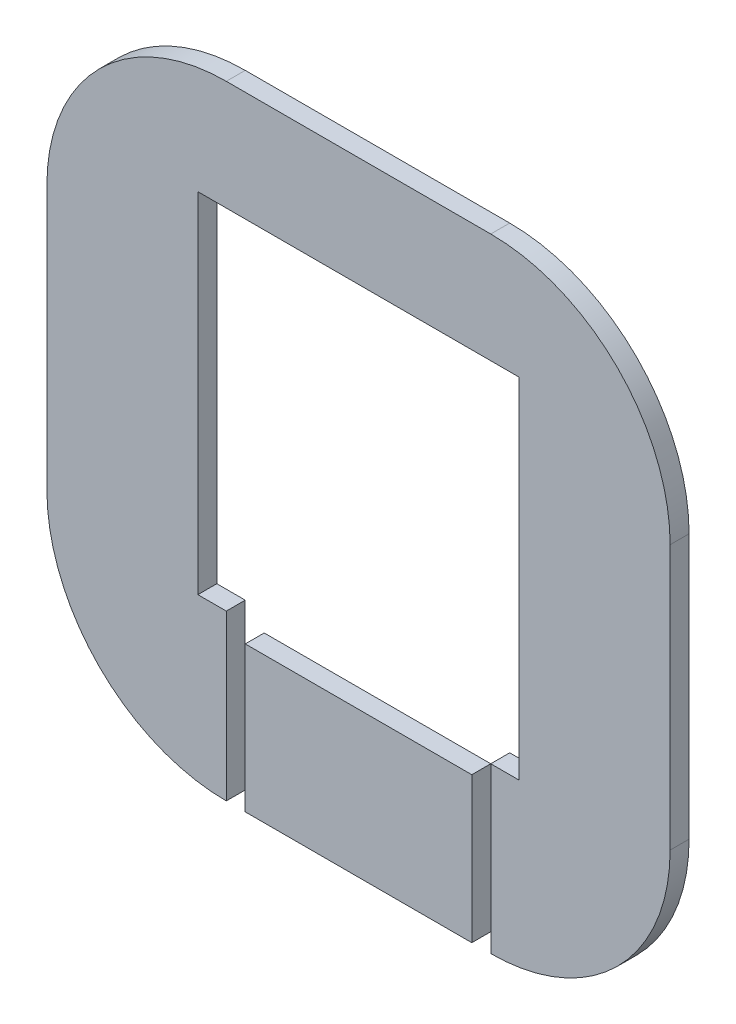
ISO-10303-21;
HEADER;
FILE_DESCRIPTION(('STEP AP214'),'2;1');
FILE_NAME('part.step','',(''),(''),'','','');
FILE_SCHEMA(('AUTOMOTIVE_DESIGN { 1 0 10303 214 1 1 1 1 }'));
ENDSEC;
DATA;
#1=APPLICATION_CONTEXT('core data for automotive mechanical design processes');
#2=APPLICATION_PROTOCOL_DEFINITION('international standard','automotive_design',2000,#1);
#3=PRODUCT_CONTEXT('',#1,'mechanical');
#4=PRODUCT('Part','Part','',(#3));
#5=PRODUCT_RELATED_PRODUCT_CATEGORY('part','',(#4));
#6=PRODUCT_DEFINITION_FORMATION('','',#4);
#7=PRODUCT_DEFINITION_CONTEXT('part definition',#1,'design');
#8=PRODUCT_DEFINITION('design','',#6,#7);
#9=PRODUCT_DEFINITION_SHAPE('','',#8);
#10=(LENGTH_UNIT() NAMED_UNIT(*) SI_UNIT(.MILLI.,.METRE.));
#11=(NAMED_UNIT(*) PLANE_ANGLE_UNIT() SI_UNIT($,.RADIAN.));
#12=(NAMED_UNIT(*) SI_UNIT($,.STERADIAN.) SOLID_ANGLE_UNIT());
#13=UNCERTAINTY_MEASURE_WITH_UNIT(LENGTH_MEASURE(1.E-05),#10,'distance_accuracy_value','');
#14=(GEOMETRIC_REPRESENTATION_CONTEXT(3) GLOBAL_UNCERTAINTY_ASSIGNED_CONTEXT((#13)) GLOBAL_UNIT_ASSIGNED_CONTEXT((#10,
#11,#12)) REPRESENTATION_CONTEXT('',''));
#15=CARTESIAN_POINT('',(0.,0.,0.));
#16=DIRECTION('',(0.,0.,1.));
#17=DIRECTION('',(1.,0.,0.));
#18=AXIS2_PLACEMENT_3D('',#15,#16,#17);
#19=CARTESIAN_POINT('',(30.,-51.5,4.3));
#20=DIRECTION('',(0.,0.,1.));
#21=DIRECTION('',(1.,0.,0.));
#22=AXIS2_PLACEMENT_3D('',#19,#20,#21);
#23=PLANE('',#22);
#24=DIRECTION('',(0.,1.,0.));
#25=VECTOR('',#24,1.);
#26=CARTESIAN_POINT('',(30.,0.,4.3));
#27=LINE('',#26,#25);
#28=CARTESIAN_POINT('',(30.,-92.2,4.3));
#29=VERTEX_POINT('',#28);
#30=CARTESIAN_POINT('',(30.,-54.89,4.3));
#31=VERTEX_POINT('',#30);
#32=EDGE_CURVE('E193',#29,#31,#27,.T.);
#33=ORIENTED_EDGE('',*,*,#32,.F.);
#34=CARTESIAN_POINT('',(30.,-51.5,4.3));
#35=DIRECTION('',(0.,0.,1.));
#36=DIRECTION('',(1.,0.,0.));
#37=AXIS2_PLACEMENT_3D('',#34,#35,#36);
#38=CIRCLE('',#37,40.7);
#39=CARTESIAN_POINT('',(70.7,-51.5,4.3));
#40=VERTEX_POINT('',#39);
#41=EDGE_CURVE('E260',#29,#40,#38,.T.);
#42=ORIENTED_EDGE('',*,*,#41,.T.);
#43=DIRECTION('',(0.,1.,0.));
#44=VECTOR('',#43,1.);
#45=CARTESIAN_POINT('',(70.7,8.50000000000001,4.3));
#46=LINE('',#45,#44);
#47=CARTESIAN_POINT('',(70.7,8.50000000000001,4.3));
#48=VERTEX_POINT('',#47);
#49=EDGE_CURVE('E258',#40,#48,#46,.T.);
#50=ORIENTED_EDGE('',*,*,#49,.T.);
#51=CARTESIAN_POINT('',(30.,8.50000000000001,4.3));
#52=DIRECTION('',(0.,0.,1.));
#53=DIRECTION('',(-1.,0.,0.));
#54=AXIS2_PLACEMENT_3D('',#51,#52,#53);
#55=CIRCLE('',#54,40.7);
#56=CARTESIAN_POINT('',(30.,49.2,4.3));
#57=VERTEX_POINT('',#56);
#58=EDGE_CURVE('E255',#48,#57,#55,.T.);
#59=ORIENTED_EDGE('',*,*,#58,.T.);
#60=DIRECTION('',(-1.,0.,0.));
#61=VECTOR('',#60,1.);
#62=CARTESIAN_POINT('',(-30.,49.2,4.3));
#63=LINE('',#62,#61);
#64=CARTESIAN_POINT('',(-30.,49.2,4.3));
#65=VERTEX_POINT('',#64);
#66=EDGE_CURVE('E252',#57,#65,#63,.T.);
#67=ORIENTED_EDGE('',*,*,#66,.T.);
#68=CARTESIAN_POINT('',(-30.,8.5,4.3));
#69=DIRECTION('',(0.,0.,1.));
#70=DIRECTION('',(-1.,0.,0.));
#71=AXIS2_PLACEMENT_3D('',#68,#69,#70);
#72=CIRCLE('',#71,40.7);
#73=CARTESIAN_POINT('',(-70.7,8.50000000000001,4.3));
#74=VERTEX_POINT('',#73);
#75=EDGE_CURVE('E249',#65,#74,#72,.T.);
#76=ORIENTED_EDGE('',*,*,#75,.T.);
#77=DIRECTION('',(0.,-1.,0.));
#78=VECTOR('',#77,1.);
#79=CARTESIAN_POINT('',(-70.7,8.50000000000001,4.3));
#80=LINE('',#79,#78);
#81=CARTESIAN_POINT('',(-70.7,-51.5,4.3));
#82=VERTEX_POINT('',#81);
#83=EDGE_CURVE('E246',#74,#82,#80,.T.);
#84=ORIENTED_EDGE('',*,*,#83,.T.);
#85=CARTESIAN_POINT('',(-30.,-51.5,4.3));
#86=DIRECTION('',(0.,0.,1.));
#87=DIRECTION('',(1.,0.,0.));
#88=AXIS2_PLACEMENT_3D('',#85,#86,#87);
#89=CIRCLE('',#88,40.7);
#90=CARTESIAN_POINT('',(-30.,-92.2,4.3));
#91=VERTEX_POINT('',#90);
#92=EDGE_CURVE('E203',#82,#91,#89,.T.);
#93=ORIENTED_EDGE('',*,*,#92,.T.);
#94=DIRECTION('',(0.,1.,0.));
#95=VECTOR('',#94,1.);
#96=CARTESIAN_POINT('',(-30.,0.,4.3));
#97=LINE('',#96,#95);
#98=CARTESIAN_POINT('',(-30.,-54.89,4.3));
#99=VERTEX_POINT('',#98);
#100=EDGE_CURVE('E199',#91,#99,#97,.T.);
#101=ORIENTED_EDGE('',*,*,#100,.T.);
#102=DIRECTION('',(1.,0.,0.));
#103=VECTOR('',#102,1.);
#104=CARTESIAN_POINT('',(0.,-54.89,4.3));
#105=LINE('',#104,#103);
#106=CARTESIAN_POINT('',(-36.45,-54.89,4.3));
#107=VERTEX_POINT('',#106);
#108=EDGE_CURVE('E159',#107,#99,#105,.T.);
#109=ORIENTED_EDGE('',*,*,#108,.F.);
#110=DIRECTION('',(0.,-1.,0.));
#111=VECTOR('',#110,1.);
#112=CARTESIAN_POINT('',(-36.45,0.,4.3));
#113=LINE('',#112,#111);
#114=CARTESIAN_POINT('',(-36.45,24.29,4.3));
#115=VERTEX_POINT('',#114);
#116=EDGE_CURVE('E155',#115,#107,#113,.T.);
#117=ORIENTED_EDGE('',*,*,#116,.F.);
#118=DIRECTION('',(1.,0.,0.));
#119=VECTOR('',#118,1.);
#120=CARTESIAN_POINT('',(0.,24.29,4.3));
#121=LINE('',#120,#119);
#122=CARTESIAN_POINT('',(36.45,24.29,4.3));
#123=VERTEX_POINT('',#122);
#124=EDGE_CURVE('E202',#115,#123,#121,.T.);
#125=ORIENTED_EDGE('',*,*,#124,.T.);
#126=DIRECTION('',(0.,-1.,0.));
#127=VECTOR('',#126,1.);
#128=CARTESIAN_POINT('',(36.45,0.,4.3));
#129=LINE('',#128,#127);
#130=CARTESIAN_POINT('',(36.45,-54.89,4.3));
#131=VERTEX_POINT('',#130);
#132=EDGE_CURVE('E207',#123,#131,#129,.T.);
#133=ORIENTED_EDGE('',*,*,#132,.T.);
#134=EDGE_CURVE('E194',#31,#131,#105,.T.);
#135=ORIENTED_EDGE('',*,*,#134,.F.);
#136=EDGE_LOOP('',(#33,#42,#50,#59,#67,#76,#84,#93,#101,#109,#117,#125,#133,#135));
#137=FACE_BOUND('',#136,.T.);
#138=ADVANCED_FACE('F92',(#137),#23,.T.);
#139=CARTESIAN_POINT('',(30.,-51.5,0.));
#140=DIRECTION('',(0.,0.,1.));
#141=DIRECTION('',(1.,0.,0.));
#142=AXIS2_PLACEMENT_3D('',#139,#140,#141);
#143=PLANE('',#142);
#144=CARTESIAN_POINT('',(30.,-51.5,0.));
#145=DIRECTION('',(0.,0.,1.));
#146=DIRECTION('',(1.,0.,0.));
#147=AXIS2_PLACEMENT_3D('',#144,#145,#146);
#148=CIRCLE('',#147,40.7);
#149=CARTESIAN_POINT('',(30.,-92.2,0.));
#150=VERTEX_POINT('',#149);
#151=CARTESIAN_POINT('',(70.7,-51.5,0.));
#152=VERTEX_POINT('',#151);
#153=EDGE_CURVE('E168',#150,#152,#148,.T.);
#154=ORIENTED_EDGE('',*,*,#153,.F.);
#155=DIRECTION('',(0.,1.,0.));
#156=VECTOR('',#155,1.);
#157=CARTESIAN_POINT('',(30.,0.,0.));
#158=LINE('',#157,#156);
#159=CARTESIAN_POINT('',(30.,-54.89,0.));
#160=VERTEX_POINT('',#159);
#161=EDGE_CURVE('E178',#150,#160,#158,.T.);
#162=ORIENTED_EDGE('',*,*,#161,.T.);
#163=DIRECTION('',(1.,0.,0.));
#164=VECTOR('',#163,1.);
#165=CARTESIAN_POINT('',(0.,-54.89,0.));
#166=LINE('',#165,#164);
#167=CARTESIAN_POINT('',(36.45,-54.89,0.));
#168=VERTEX_POINT('',#167);
#169=EDGE_CURVE('E170',#160,#168,#166,.T.);
#170=ORIENTED_EDGE('',*,*,#169,.T.);
#171=DIRECTION('',(0.,-1.,0.));
#172=VECTOR('',#171,1.);
#173=CARTESIAN_POINT('',(36.45,0.,0.));
#174=LINE('',#173,#172);
#175=CARTESIAN_POINT('',(36.45,24.29,0.));
#176=VERTEX_POINT('',#175);
#177=EDGE_CURVE('E95',#176,#168,#174,.T.);
#178=ORIENTED_EDGE('',*,*,#177,.F.);
#179=DIRECTION('',(1.,0.,0.));
#180=VECTOR('',#179,1.);
#181=CARTESIAN_POINT('',(0.,24.29,0.));
#182=LINE('',#181,#180);
#183=CARTESIAN_POINT('',(-36.45,24.29,0.));
#184=VERTEX_POINT('',#183);
#185=EDGE_CURVE('E175',#184,#176,#182,.T.);
#186=ORIENTED_EDGE('',*,*,#185,.F.);
#187=DIRECTION('',(0.,-1.,0.));
#188=VECTOR('',#187,1.);
#189=CARTESIAN_POINT('',(-36.45,0.,0.));
#190=LINE('',#189,#188);
#191=CARTESIAN_POINT('',(-36.45,-54.89,0.));
#192=VERTEX_POINT('',#191);
#193=EDGE_CURVE('E152',#184,#192,#190,.T.);
#194=ORIENTED_EDGE('',*,*,#193,.T.);
#195=CARTESIAN_POINT('',(-30.,-54.89,0.));
#196=VERTEX_POINT('',#195);
#197=EDGE_CURVE('E163',#192,#196,#166,.T.);
#198=ORIENTED_EDGE('',*,*,#197,.T.);
#199=DIRECTION('',(0.,1.,0.));
#200=VECTOR('',#199,1.);
#201=CARTESIAN_POINT('',(-30.,0.,0.));
#202=LINE('',#201,#200);
#203=CARTESIAN_POINT('',(-30.,-92.2,0.));
#204=VERTEX_POINT('',#203);
#205=EDGE_CURVE('E191',#204,#196,#202,.T.);
#206=ORIENTED_EDGE('',*,*,#205,.F.);
#207=CARTESIAN_POINT('',(-30.,-51.5,0.));
#208=DIRECTION('',(0.,0.,1.));
#209=DIRECTION('',(1.,0.,0.));
#210=AXIS2_PLACEMENT_3D('',#207,#208,#209);
#211=CIRCLE('',#210,40.7);
#212=CARTESIAN_POINT('',(-70.7,-51.5,0.));
#213=VERTEX_POINT('',#212);
#214=EDGE_CURVE('E218',#213,#204,#211,.T.);
#215=ORIENTED_EDGE('',*,*,#214,.F.);
#216=DIRECTION('',(0.,-1.,0.));
#217=VECTOR('',#216,1.);
#218=CARTESIAN_POINT('',(-70.7,8.50000000000001,0.));
#219=LINE('',#218,#217);
#220=CARTESIAN_POINT('',(-70.7,8.50000000000001,0.));
#221=VERTEX_POINT('',#220);
#222=EDGE_CURVE('E222',#221,#213,#219,.T.);
#223=ORIENTED_EDGE('',*,*,#222,.F.);
#224=CARTESIAN_POINT('',(-30.,8.5,0.));
#225=DIRECTION('',(0.,0.,1.));
#226=DIRECTION('',(-1.,0.,0.));
#227=AXIS2_PLACEMENT_3D('',#224,#225,#226);
#228=CIRCLE('',#227,40.7);
#229=CARTESIAN_POINT('',(-30.,49.2,0.));
#230=VERTEX_POINT('',#229);
#231=EDGE_CURVE('E226',#230,#221,#228,.T.);
#232=ORIENTED_EDGE('',*,*,#231,.F.);
#233=DIRECTION('',(-1.,0.,0.));
#234=VECTOR('',#233,1.);
#235=CARTESIAN_POINT('',(-30.,49.2,0.));
#236=LINE('',#235,#234);
#237=CARTESIAN_POINT('',(30.,49.2,0.));
#238=VERTEX_POINT('',#237);
#239=EDGE_CURVE('E230',#238,#230,#236,.T.);
#240=ORIENTED_EDGE('',*,*,#239,.F.);
#241=CARTESIAN_POINT('',(30.,8.50000000000001,0.));
#242=DIRECTION('',(0.,0.,1.));
#243=DIRECTION('',(-1.,0.,0.));
#244=AXIS2_PLACEMENT_3D('',#241,#242,#243);
#245=CIRCLE('',#244,40.7);
#246=CARTESIAN_POINT('',(70.7,8.50000000000001,0.));
#247=VERTEX_POINT('',#246);
#248=EDGE_CURVE('E234',#247,#238,#245,.T.);
#249=ORIENTED_EDGE('',*,*,#248,.F.);
#250=DIRECTION('',(0.,1.,0.));
#251=VECTOR('',#250,1.);
#252=CARTESIAN_POINT('',(70.7,8.50000000000001,0.));
#253=LINE('',#252,#251);
#254=EDGE_CURVE('E238',#152,#247,#253,.T.);
#255=ORIENTED_EDGE('',*,*,#254,.F.);
#256=EDGE_LOOP('',(#154,#162,#170,#178,#186,#194,#198,#206,#215,#223,#232,#240,#249,#255));
#257=FACE_BOUND('',#256,.T.);
#258=ADVANCED_FACE('F172',(#257),#143,.F.);
#259=CARTESIAN_POINT('',(30.,-51.5,4.3));
#260=DIRECTION('',(0.,0.,-1.));
#261=DIRECTION('',(-1.,0.,0.));
#262=AXIS2_PLACEMENT_3D('',#259,#260,#261);
#263=CYLINDRICAL_SURFACE('',#262,40.7);
#264=ORIENTED_EDGE('',*,*,#153,.T.);
#265=DIRECTION('',(0.,0.,-1.));
#266=VECTOR('',#265,1.);
#267=CARTESIAN_POINT('',(70.7,-51.5,4.3));
#268=LINE('',#267,#266);
#269=EDGE_CURVE('E237',#40,#152,#268,.T.);
#270=ORIENTED_EDGE('',*,*,#269,.F.);
#271=ORIENTED_EDGE('',*,*,#41,.F.);
#272=DIRECTION('',(0.,0.,-1.));
#273=VECTOR('',#272,1.);
#274=CARTESIAN_POINT('',(30.,-92.2,4.3));
#275=LINE('',#274,#273);
#276=EDGE_CURVE('E241',#29,#150,#275,.T.);
#277=ORIENTED_EDGE('',*,*,#276,.T.);
#278=EDGE_LOOP('',(#264,#270,#271,#277));
#279=FACE_BOUND('',#278,.T.);
#280=ADVANCED_FACE('F275',(#279),#263,.T.);
#281=CARTESIAN_POINT('',(70.7,8.50000000000001,4.3));
#282=DIRECTION('',(-1.,0.,0.));
#283=DIRECTION('',(0.,-1.,0.));
#284=AXIS2_PLACEMENT_3D('',#281,#282,#283);
#285=PLANE('',#284);
#286=ORIENTED_EDGE('',*,*,#254,.T.);
#287=DIRECTION('',(0.,0.,-1.));
#288=VECTOR('',#287,1.);
#289=CARTESIAN_POINT('',(70.7,8.50000000000001,4.3));
#290=LINE('',#289,#288);
#291=EDGE_CURVE('E233',#48,#247,#290,.T.);
#292=ORIENTED_EDGE('',*,*,#291,.F.);
#293=ORIENTED_EDGE('',*,*,#49,.F.);
#294=ORIENTED_EDGE('',*,*,#269,.T.);
#295=EDGE_LOOP('',(#286,#292,#293,#294));
#296=FACE_BOUND('',#295,.T.);
#297=ADVANCED_FACE('F280',(#296),#285,.F.);
#298=CARTESIAN_POINT('',(30.,8.50000000000001,4.3));
#299=DIRECTION('',(0.,0.,-1.));
#300=DIRECTION('',(-1.,0.,0.));
#301=AXIS2_PLACEMENT_3D('',#298,#299,#300);
#302=CYLINDRICAL_SURFACE('',#301,40.7);
#303=ORIENTED_EDGE('',*,*,#248,.T.);
#304=DIRECTION('',(0.,0.,-1.));
#305=VECTOR('',#304,1.);
#306=CARTESIAN_POINT('',(30.,49.2,4.3));
#307=LINE('',#306,#305);
#308=EDGE_CURVE('E229',#57,#238,#307,.T.);
#309=ORIENTED_EDGE('',*,*,#308,.F.);
#310=ORIENTED_EDGE('',*,*,#58,.F.);
#311=ORIENTED_EDGE('',*,*,#291,.T.);
#312=EDGE_LOOP('',(#303,#309,#310,#311));
#313=FACE_BOUND('',#312,.T.);
#314=ADVANCED_FACE('F290',(#313),#302,.T.);
#315=CARTESIAN_POINT('',(-30.,49.2,4.3));
#316=DIRECTION('',(0.,-1.,0.));
#317=DIRECTION('',(1.,0.,0.));
#318=AXIS2_PLACEMENT_3D('',#315,#316,#317);
#319=PLANE('',#318);
#320=ORIENTED_EDGE('',*,*,#239,.T.);
#321=DIRECTION('',(0.,0.,-1.));
#322=VECTOR('',#321,1.);
#323=CARTESIAN_POINT('',(-30.,49.2,4.3));
#324=LINE('',#323,#322);
#325=EDGE_CURVE('E225',#65,#230,#324,.T.);
#326=ORIENTED_EDGE('',*,*,#325,.F.);
#327=ORIENTED_EDGE('',*,*,#66,.F.);
#328=ORIENTED_EDGE('',*,*,#308,.T.);
#329=EDGE_LOOP('',(#320,#326,#327,#328));
#330=FACE_BOUND('',#329,.T.);
#331=ADVANCED_FACE('F371',(#330),#319,.F.);
#332=CARTESIAN_POINT('',(-30.,8.5,4.3));
#333=DIRECTION('',(0.,0.,-1.));
#334=DIRECTION('',(-1.,0.,0.));
#335=AXIS2_PLACEMENT_3D('',#332,#333,#334);
#336=CYLINDRICAL_SURFACE('',#335,40.7);
#337=ORIENTED_EDGE('',*,*,#231,.T.);
#338=DIRECTION('',(0.,0.,-1.));
#339=VECTOR('',#338,1.);
#340=CARTESIAN_POINT('',(-70.7,8.50000000000001,4.3));
#341=LINE('',#340,#339);
#342=EDGE_CURVE('E221',#74,#221,#341,.T.);
#343=ORIENTED_EDGE('',*,*,#342,.F.);
#344=ORIENTED_EDGE('',*,*,#75,.F.);
#345=ORIENTED_EDGE('',*,*,#325,.T.);
#346=EDGE_LOOP('',(#337,#343,#344,#345));
#347=FACE_BOUND('',#346,.T.);
#348=ADVANCED_FACE('F319',(#347),#336,.T.);
#349=CARTESIAN_POINT('',(-70.7,8.50000000000001,4.3));
#350=DIRECTION('',(1.,0.,0.));
#351=DIRECTION('',(0.,0.,-1.));
#352=AXIS2_PLACEMENT_3D('',#349,#350,#351);
#353=PLANE('',#352);
#354=ORIENTED_EDGE('',*,*,#222,.T.);
#355=DIRECTION('',(0.,0.,-1.));
#356=VECTOR('',#355,1.);
#357=CARTESIAN_POINT('',(-70.7,-51.5,4.3));
#358=LINE('',#357,#356);
#359=EDGE_CURVE('E216',#82,#213,#358,.T.);
#360=ORIENTED_EDGE('',*,*,#359,.F.);
#361=ORIENTED_EDGE('',*,*,#83,.F.);
#362=ORIENTED_EDGE('',*,*,#342,.T.);
#363=EDGE_LOOP('',(#354,#360,#361,#362));
#364=FACE_BOUND('',#363,.T.);
#365=ADVANCED_FACE('F324',(#364),#353,.F.);
#366=CARTESIAN_POINT('',(-30.,-51.5,4.3));
#367=DIRECTION('',(0.,0.,-1.));
#368=DIRECTION('',(-1.,0.,0.));
#369=AXIS2_PLACEMENT_3D('',#366,#367,#368);
#370=CYLINDRICAL_SURFACE('',#369,40.7);
#371=ORIENTED_EDGE('',*,*,#214,.T.);
#372=DIRECTION('',(0.,0.,-1.));
#373=VECTOR('',#372,1.);
#374=CARTESIAN_POINT('',(-30.,-92.2,4.3));
#375=LINE('',#374,#373);
#376=EDGE_CURVE('E198',#91,#204,#375,.T.);
#377=ORIENTED_EDGE('',*,*,#376,.F.);
#378=ORIENTED_EDGE('',*,*,#92,.F.);
#379=ORIENTED_EDGE('',*,*,#359,.T.);
#380=EDGE_LOOP('',(#371,#377,#378,#379));
#381=FACE_BOUND('',#380,.T.);
#382=ADVANCED_FACE('F329',(#381),#370,.T.);
#383=CARTESIAN_POINT('',(0.,-54.89,0.));
#384=DIRECTION('',(0.,-1.,0.));
#385=DIRECTION('',(0.,0.,-1.));
#386=AXIS2_PLACEMENT_3D('',#383,#384,#385);
#387=PLANE('',#386);
#388=ORIENTED_EDGE('',*,*,#134,.T.);
#389=DIRECTION('',(0.,0.,1.));
#390=VECTOR('',#389,1.);
#391=CARTESIAN_POINT('',(36.45,-54.89,0.));
#392=LINE('',#391,#390);
#393=EDGE_CURVE('E13',#168,#131,#392,.T.);
#394=ORIENTED_EDGE('',*,*,#393,.F.);
#395=ORIENTED_EDGE('',*,*,#169,.F.);
#396=DIRECTION('',(0.,0.,1.));
#397=VECTOR('',#396,1.);
#398=CARTESIAN_POINT('',(30.,-54.89,0.));
#399=LINE('',#398,#397);
#400=EDGE_CURVE('E192',#160,#31,#399,.T.);
#401=ORIENTED_EDGE('',*,*,#400,.T.);
#402=EDGE_LOOP('',(#388,#394,#395,#401));
#403=FACE_BOUND('',#402,.T.);
#404=ADVANCED_FACE('F338',(#403),#387,.F.);
#405=CARTESIAN_POINT('',(30.,0.,0.));
#406=DIRECTION('',(1.,0.,0.));
#407=DIRECTION('',(0.,0.,-1.));
#408=AXIS2_PLACEMENT_3D('',#405,#406,#407);
#409=PLANE('',#408);
#410=ORIENTED_EDGE('',*,*,#32,.T.);
#411=ORIENTED_EDGE('',*,*,#400,.F.);
#412=ORIENTED_EDGE('',*,*,#161,.F.);
#413=ORIENTED_EDGE('',*,*,#276,.F.);
#414=EDGE_LOOP('',(#410,#411,#412,#413));
#415=FACE_BOUND('',#414,.T.);
#416=ADVANCED_FACE('F302',(#415),#409,.F.);
#417=CARTESIAN_POINT('',(-30.,0.,0.));
#418=DIRECTION('',(1.,0.,0.));
#419=DIRECTION('',(0.,0.,-1.));
#420=AXIS2_PLACEMENT_3D('',#417,#418,#419);
#421=PLANE('',#420);
#422=ORIENTED_EDGE('',*,*,#100,.F.);
#423=ORIENTED_EDGE('',*,*,#376,.T.);
#424=ORIENTED_EDGE('',*,*,#205,.T.);
#425=DIRECTION('',(0.,0.,1.));
#426=VECTOR('',#425,1.);
#427=CARTESIAN_POINT('',(-30.,-54.89,0.));
#428=LINE('',#427,#426);
#429=EDGE_CURVE('E165',#196,#99,#428,.T.);
#430=ORIENTED_EDGE('',*,*,#429,.T.);
#431=EDGE_LOOP('',(#422,#423,#424,#430));
#432=FACE_BOUND('',#431,.T.);
#433=ADVANCED_FACE('F330',(#432),#421,.T.);
#434=ORIENTED_EDGE('',*,*,#108,.T.);
#435=ORIENTED_EDGE('',*,*,#429,.F.);
#436=ORIENTED_EDGE('',*,*,#197,.F.);
#437=DIRECTION('',(0.,0.,1.));
#438=VECTOR('',#437,1.);
#439=CARTESIAN_POINT('',(-36.45,-54.89,0.));
#440=LINE('',#439,#438);
#441=EDGE_CURVE('E148',#192,#107,#440,.T.);
#442=ORIENTED_EDGE('',*,*,#441,.T.);
#443=EDGE_LOOP('',(#434,#435,#436,#442));
#444=FACE_BOUND('',#443,.T.);
#445=ADVANCED_FACE('F164',(#444),#387,.F.);
#446=CARTESIAN_POINT('',(-36.45,0.,0.));
#447=DIRECTION('',(-1.,0.,0.));
#448=DIRECTION('',(0.,-1.,0.));
#449=AXIS2_PLACEMENT_3D('',#446,#447,#448);
#450=PLANE('',#449);
#451=ORIENTED_EDGE('',*,*,#116,.T.);
#452=ORIENTED_EDGE('',*,*,#441,.F.);
#453=ORIENTED_EDGE('',*,*,#193,.F.);
#454=DIRECTION('',(0.,0.,1.));
#455=VECTOR('',#454,1.);
#456=CARTESIAN_POINT('',(-36.45,24.29,0.));
#457=LINE('',#456,#455);
#458=EDGE_CURVE('E181',#184,#115,#457,.T.);
#459=ORIENTED_EDGE('',*,*,#458,.T.);
#460=EDGE_LOOP('',(#451,#452,#453,#459));
#461=FACE_BOUND('',#460,.T.);
#462=ADVANCED_FACE('F150',(#461),#450,.F.);
#463=CARTESIAN_POINT('',(0.,24.29,0.));
#464=DIRECTION('',(0.,-1.,0.));
#465=DIRECTION('',(0.,0.,-1.));
#466=AXIS2_PLACEMENT_3D('',#463,#464,#465);
#467=PLANE('',#466);
#468=ORIENTED_EDGE('',*,*,#124,.F.);
#469=ORIENTED_EDGE('',*,*,#458,.F.);
#470=ORIENTED_EDGE('',*,*,#185,.T.);
#471=DIRECTION('',(0.,0.,1.));
#472=VECTOR('',#471,1.);
#473=CARTESIAN_POINT('',(36.45,24.29,0.));
#474=LINE('',#473,#472);
#475=EDGE_CURVE('E180',#176,#123,#474,.T.);
#476=ORIENTED_EDGE('',*,*,#475,.T.);
#477=EDGE_LOOP('',(#468,#469,#470,#476));
#478=FACE_BOUND('',#477,.T.);
#479=ADVANCED_FACE('F358',(#478),#467,.T.);
#480=CARTESIAN_POINT('',(36.45,0.,0.));
#481=DIRECTION('',(-1.,0.,0.));
#482=DIRECTION('',(0.,-1.,0.));
#483=AXIS2_PLACEMENT_3D('',#480,#481,#482);
#484=PLANE('',#483);
#485=ORIENTED_EDGE('',*,*,#132,.F.);
#486=ORIENTED_EDGE('',*,*,#475,.F.);
#487=ORIENTED_EDGE('',*,*,#177,.T.);
#488=ORIENTED_EDGE('',*,*,#393,.T.);
#489=EDGE_LOOP('',(#485,#486,#487,#488));
#490=FACE_BOUND('',#489,.T.);
#491=ADVANCED_FACE('F356',(#490),#484,.T.);
#492=CLOSED_SHELL('',(#138,#258,#280,#297,#314,#331,#348,#365,#382,#404,#416,#433,#445,#462,
#479,#491));
#493=MANIFOLD_SOLID_BREP('B2',#492);
#494=CARTESIAN_POINT('',(30.,-51.5,0.));
#495=DIRECTION('',(0.,0.,1.));
#496=DIRECTION('',(1.,0.,0.));
#497=AXIS2_PLACEMENT_3D('',#494,#495,#496);
#498=PLANE('',#497);
#499=DIRECTION('',(1.,0.,0.));
#500=VECTOR('',#499,1.);
#501=CARTESIAN_POINT('',(0.500000000000032,-92.2,0.));
#502=LINE('',#501,#500);
#503=CARTESIAN_POINT('',(-25.7,-92.2,0.));
#504=VERTEX_POINT('',#503);
#505=CARTESIAN_POINT('',(25.7,-92.2,0.));
#506=VERTEX_POINT('',#505);
#507=EDGE_CURVE('E488',#504,#506,#502,.T.);
#508=ORIENTED_EDGE('',*,*,#507,.F.);
#509=DIRECTION('',(0.,1.,0.));
#510=VECTOR('',#509,1.);
#511=CARTESIAN_POINT('',(-25.7,0.,0.));
#512=LINE('',#511,#510);
#513=CARTESIAN_POINT('',(-25.7,-59.19,0.));
#514=VERTEX_POINT('',#513);
#515=EDGE_CURVE('E531',#504,#514,#512,.T.);
#516=ORIENTED_EDGE('',*,*,#515,.T.);
#517=DIRECTION('',(1.,0.,0.));
#518=VECTOR('',#517,1.);
#519=CARTESIAN_POINT('',(0.,-59.19,0.));
#520=LINE('',#519,#518);
#521=CARTESIAN_POINT('',(25.7,-59.19,0.));
#522=VERTEX_POINT('',#521);
#523=EDGE_CURVE('E537',#514,#522,#520,.T.);
#524=ORIENTED_EDGE('',*,*,#523,.T.);
#525=DIRECTION('',(0.,-1.,0.));
#526=VECTOR('',#525,1.);
#527=CARTESIAN_POINT('',(25.7,-59.19,0.));
#528=LINE('',#527,#526);
#529=EDGE_CURVE('E544',#522,#506,#528,.T.);
#530=ORIENTED_EDGE('',*,*,#529,.T.);
#531=EDGE_LOOP('',(#508,#516,#524,#530));
#532=FACE_BOUND('',#531,.T.);
#533=ADVANCED_FACE('F484',(#532),#498,.F.);
#534=CARTESIAN_POINT('',(30.,-51.5,4.3));
#535=DIRECTION('',(0.,0.,1.));
#536=DIRECTION('',(1.,0.,0.));
#537=AXIS2_PLACEMENT_3D('',#534,#535,#536);
#538=PLANE('',#537);
#539=DIRECTION('',(0.,1.,0.));
#540=VECTOR('',#539,1.);
#541=CARTESIAN_POINT('',(-25.7,0.,4.3));
#542=LINE('',#541,#540);
#543=CARTESIAN_POINT('',(-25.7,-92.2,4.3));
#544=VERTEX_POINT('',#543);
#545=CARTESIAN_POINT('',(-25.7,-59.19,4.3));
#546=VERTEX_POINT('',#545);
#547=EDGE_CURVE('E550',#544,#546,#542,.T.);
#548=ORIENTED_EDGE('',*,*,#547,.F.);
#549=DIRECTION('',(1.,0.,0.));
#550=VECTOR('',#549,1.);
#551=CARTESIAN_POINT('',(-30.,-92.2,4.3));
#552=LINE('',#551,#550);
#553=CARTESIAN_POINT('',(25.7,-92.2,4.3));
#554=VERTEX_POINT('',#553);
#555=EDGE_CURVE('E90',#544,#554,#552,.T.);
#556=ORIENTED_EDGE('',*,*,#555,.T.);
#557=DIRECTION('',(0.,-1.,0.));
#558=VECTOR('',#557,1.);
#559=CARTESIAN_POINT('',(25.7,-59.19,4.3));
#560=LINE('',#559,#558);
#561=CARTESIAN_POINT('',(25.7,-59.19,4.3));
#562=VERTEX_POINT('',#561);
#563=EDGE_CURVE('E515',#562,#554,#560,.T.);
#564=ORIENTED_EDGE('',*,*,#563,.F.);
#565=DIRECTION('',(1.,0.,0.));
#566=VECTOR('',#565,1.);
#567=CARTESIAN_POINT('',(0.,-59.19,4.3));
#568=LINE('',#567,#566);
#569=EDGE_CURVE('E538',#546,#562,#568,.T.);
#570=ORIENTED_EDGE('',*,*,#569,.F.);
#571=EDGE_LOOP('',(#548,#556,#564,#570));
#572=FACE_BOUND('',#571,.T.);
#573=ADVANCED_FACE('F557',(#572),#538,.T.);
#574=CARTESIAN_POINT('',(0.500000000000032,-92.2,4.3));
#575=DIRECTION('',(0.,1.,0.));
#576=DIRECTION('',(0.,0.,1.));
#577=AXIS2_PLACEMENT_3D('',#574,#575,#576);
#578=PLANE('',#577);
#579=ORIENTED_EDGE('',*,*,#555,.F.);
#580=DIRECTION('',(0.,0.,1.));
#581=VECTOR('',#580,1.);
#582=CARTESIAN_POINT('',(-25.7,-92.2,0.));
#583=LINE('',#582,#581);
#584=EDGE_CURVE('E523',#504,#544,#583,.T.);
#585=ORIENTED_EDGE('',*,*,#584,.F.);
#586=ORIENTED_EDGE('',*,*,#507,.T.);
#587=DIRECTION('',(0.,0.,1.));
#588=VECTOR('',#587,1.);
#589=CARTESIAN_POINT('',(25.7,-92.2,0.));
#590=LINE('',#589,#588);
#591=EDGE_CURVE('E499',#506,#554,#590,.T.);
#592=ORIENTED_EDGE('',*,*,#591,.T.);
#593=EDGE_LOOP('',(#579,#585,#586,#592));
#594=FACE_BOUND('',#593,.T.);
#595=ADVANCED_FACE('F486',(#594),#578,.F.);
#596=CARTESIAN_POINT('',(-25.7,0.,0.));
#597=DIRECTION('',(1.,0.,0.));
#598=DIRECTION('',(0.,0.,-1.));
#599=AXIS2_PLACEMENT_3D('',#596,#597,#598);
#600=PLANE('',#599);
#601=ORIENTED_EDGE('',*,*,#547,.T.);
#602=DIRECTION('',(0.,0.,1.));
#603=VECTOR('',#602,1.);
#604=CARTESIAN_POINT('',(-25.7,-59.19,0.));
#605=LINE('',#604,#603);
#606=EDGE_CURVE('E533',#514,#546,#605,.T.);
#607=ORIENTED_EDGE('',*,*,#606,.F.);
#608=ORIENTED_EDGE('',*,*,#515,.F.);
#609=ORIENTED_EDGE('',*,*,#584,.T.);
#610=EDGE_LOOP('',(#601,#607,#608,#609));
#611=FACE_BOUND('',#610,.T.);
#612=ADVANCED_FACE('F532',(#611),#600,.F.);
#613=CARTESIAN_POINT('',(25.7,-59.19,0.));
#614=DIRECTION('',(-1.,0.,0.));
#615=DIRECTION('',(0.,-1.,0.));
#616=AXIS2_PLACEMENT_3D('',#613,#614,#615);
#617=PLANE('',#616);
#618=ORIENTED_EDGE('',*,*,#563,.T.);
#619=ORIENTED_EDGE('',*,*,#591,.F.);
#620=ORIENTED_EDGE('',*,*,#529,.F.);
#621=DIRECTION('',(0.,0.,-1.));
#622=VECTOR('',#621,1.);
#623=CARTESIAN_POINT('',(25.7,-59.19,0.));
#624=LINE('',#623,#622);
#625=EDGE_CURVE('E508',#562,#522,#624,.T.);
#626=ORIENTED_EDGE('',*,*,#625,.F.);
#627=EDGE_LOOP('',(#618,#619,#620,#626));
#628=FACE_BOUND('',#627,.T.);
#629=ADVANCED_FACE('F565',(#628),#617,.F.);
#630=CARTESIAN_POINT('',(0.,-59.19,0.));
#631=DIRECTION('',(0.,-1.,0.));
#632=DIRECTION('',(0.,0.,-1.));
#633=AXIS2_PLACEMENT_3D('',#630,#631,#632);
#634=PLANE('',#633);
#635=ORIENTED_EDGE('',*,*,#625,.T.);
#636=ORIENTED_EDGE('',*,*,#523,.F.);
#637=ORIENTED_EDGE('',*,*,#606,.T.);
#638=ORIENTED_EDGE('',*,*,#569,.T.);
#639=EDGE_LOOP('',(#635,#636,#637,#638));
#640=FACE_BOUND('',#639,.T.);
#641=ADVANCED_FACE('F555',(#640),#634,.F.);
#642=CLOSED_SHELL('',(#533,#573,#595,#612,#629,#641));
#643=MANIFOLD_SOLID_BREP('B7',#642);
#644=ADVANCED_BREP_SHAPE_REPRESENTATION('',(#18,#493,#643),#14);
#645=SHAPE_DEFINITION_REPRESENTATION(#9,#644);
ENDSEC;
END-ISO-10303-21;
